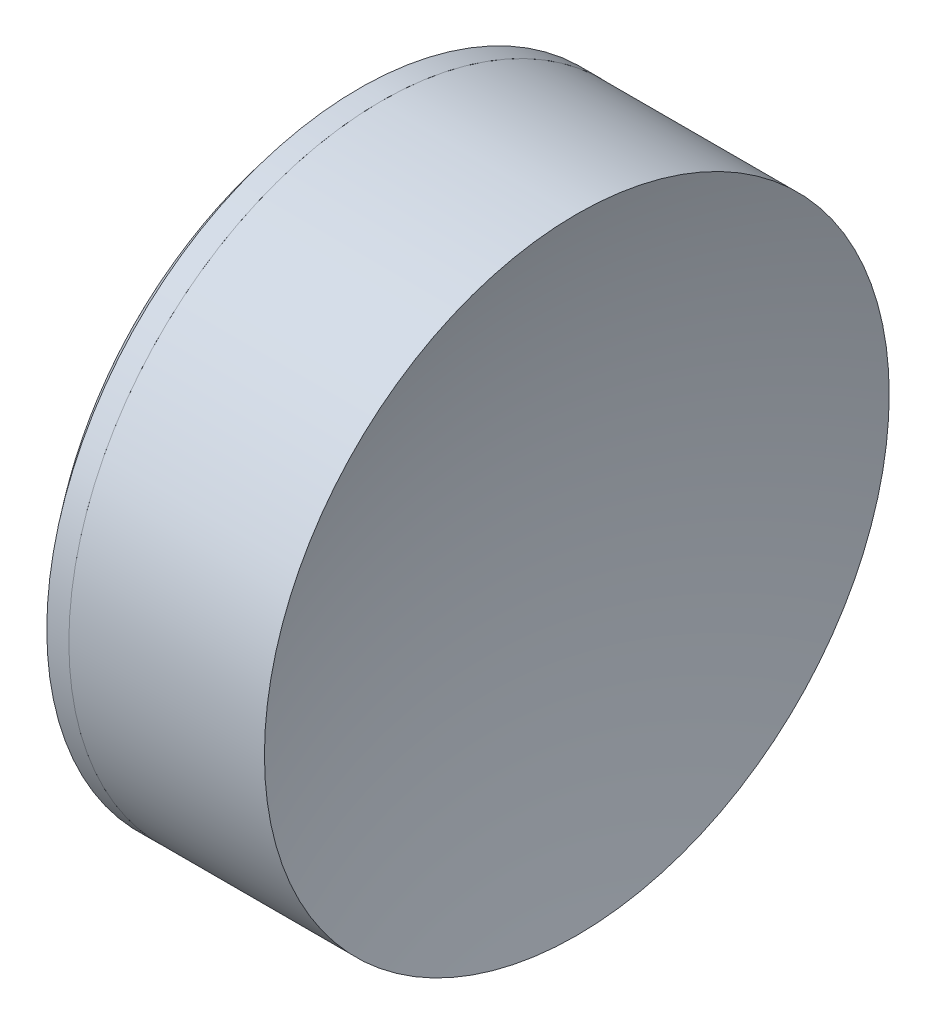
ISO-10303-21;
HEADER;
FILE_DESCRIPTION(('STEP AP214'),'2;1');
FILE_NAME('part.step','',(''),(''),'','','');
FILE_SCHEMA(('AUTOMOTIVE_DESIGN { 1 0 10303 214 1 1 1 1 }'));
ENDSEC;
DATA;
#1=APPLICATION_CONTEXT('core data for automotive mechanical design processes');
#2=APPLICATION_PROTOCOL_DEFINITION('international standard','automotive_design',2000,#1);
#3=PRODUCT_CONTEXT('',#1,'mechanical');
#4=PRODUCT('Part','Part','',(#3));
#5=PRODUCT_RELATED_PRODUCT_CATEGORY('part','',(#4));
#6=PRODUCT_DEFINITION_FORMATION('','',#4);
#7=PRODUCT_DEFINITION_CONTEXT('part definition',#1,'design');
#8=PRODUCT_DEFINITION('design','',#6,#7);
#9=PRODUCT_DEFINITION_SHAPE('','',#8);
#10=(LENGTH_UNIT() NAMED_UNIT(*) SI_UNIT(.MILLI.,.METRE.));
#11=(NAMED_UNIT(*) PLANE_ANGLE_UNIT() SI_UNIT($,.RADIAN.));
#12=(NAMED_UNIT(*) SI_UNIT($,.STERADIAN.) SOLID_ANGLE_UNIT());
#13=UNCERTAINTY_MEASURE_WITH_UNIT(LENGTH_MEASURE(1.E-05),#10,'distance_accuracy_value','');
#14=(GEOMETRIC_REPRESENTATION_CONTEXT(3) GLOBAL_UNCERTAINTY_ASSIGNED_CONTEXT((#13)) GLOBAL_UNIT_ASSIGNED_CONTEXT((#10,
#11,#12)) REPRESENTATION_CONTEXT('',''));
#15=CARTESIAN_POINT('',(0.,0.,0.));
#16=DIRECTION('',(0.,0.,1.));
#17=DIRECTION('',(1.,0.,0.));
#18=AXIS2_PLACEMENT_3D('',#15,#16,#17);
#19=CARTESIAN_POINT('',(61.3594437825909,0.,0.));
#20=DIRECTION('',(-1.,0.,0.));
#21=DIRECTION('',(0.,0.,-1.));
#22=AXIS2_PLACEMENT_3D('',#19,#20,#21);
#23=SPHERICAL_SURFACE('',#22,49.89);
#24=CARTESIAN_POINT('',(104.299542757791,0.,0.));
#25=DIRECTION('',(-1.,0.,0.));
#26=DIRECTION('',(0.,0.,1.));
#27=AXIS2_PLACEMENT_3D('',#24,#25,#26);
#28=CIRCLE('',#27,25.4);
#29=CARTESIAN_POINT('',(104.299542757791,0.,25.4));
#30=VERTEX_POINT('',#29);
#31=EDGE_CURVE('E51',#30,#30,#28,.T.);
#32=ORIENTED_EDGE('',*,*,#31,.T.);
#33=EDGE_LOOP('',(#32));
#34=FACE_BOUND('',#33,.T.);
#35=ADVANCED_FACE('F45',(#34),#23,.F.);
#36=CARTESIAN_POINT('',(199.849443782591,0.,0.));
#37=DIRECTION('',(-1.,0.,0.));
#38=DIRECTION('',(0.,0.,-1.));
#39=AXIS2_PLACEMENT_3D('',#36,#37,#38);
#40=SPHERICAL_SURFACE('',#39,83.6);
#41=CARTESIAN_POINT('',(120.201468290429,0.,0.));
#42=DIRECTION('',(-1.,0.,0.));
#43=DIRECTION('',(0.,0.,1.));
#44=AXIS2_PLACEMENT_3D('',#41,#42,#43);
#45=CIRCLE('',#44,25.4);
#46=CARTESIAN_POINT('',(120.201468290429,0.,25.4));
#47=VERTEX_POINT('',#46);
#48=EDGE_CURVE('E11',#47,#47,#45,.T.);
#49=ORIENTED_EDGE('',*,*,#48,.F.);
#50=EDGE_LOOP('',(#49));
#51=FACE_BOUND('',#50,.T.);
#52=ADVANCED_FACE('F60',(#51),#40,.F.);
#53=CARTESIAN_POINT('',(-0.551919992657797,0.,0.));
#54=DIRECTION('',(-1.,0.,0.));
#55=DIRECTION('',(0.,0.,1.));
#56=AXIS2_PLACEMENT_3D('',#53,#54,#55);
#57=CYLINDRICAL_SURFACE('',#56,25.4);
#58=ORIENTED_EDGE('',*,*,#48,.T.);
#59=EDGE_LOOP('',(#58));
#60=FACE_BOUND('',#59,.T.);
#61=ORIENTED_EDGE('',*,*,#31,.F.);
#62=EDGE_LOOP('',(#61));
#63=FACE_BOUND('',#62,.T.);
#64=ADVANCED_FACE('F58',(#60,#63),#57,.T.);
#65=CLOSED_SHELL('',(#35,#52,#64));
#66=MANIFOLD_SOLID_BREP('B2',#65);
#67=CARTESIAN_POINT('',(132.729443782591,0.,0.));
#68=DIRECTION('',(-1.,0.,0.));
#69=DIRECTION('',(0.,0.,1.));
#70=AXIS2_PLACEMENT_3D('',#67,#68,#69);
#71=SPHERICAL_SURFACE('',#70,39.48);
#72=CARTESIAN_POINT('',(102.505109215888,0.,0.));
#73=DIRECTION('',(-1.,0.,0.));
#74=DIRECTION('',(0.,0.,1.));
#75=AXIS2_PLACEMENT_3D('',#72,#73,#74);
#76=CIRCLE('',#75,25.4);
#77=CARTESIAN_POINT('',(102.505109215888,0.,25.4));
#78=VERTEX_POINT('',#77);
#79=EDGE_CURVE('E44',#78,#78,#76,.T.);
#80=ORIENTED_EDGE('',*,*,#79,.T.);
#81=EDGE_LOOP('',(#80));
#82=FACE_BOUND('',#81,.T.);
#83=ADVANCED_FACE('F86',(#82),#71,.T.);
#84=CARTESIAN_POINT('',(-0.816062176165804,0.,0.));
#85=DIRECTION('',(-1.,0.,0.));
#86=DIRECTION('',(0.,0.,1.));
#87=AXIS2_PLACEMENT_3D('',#84,#85,#86);
#88=CYLINDRICAL_SURFACE('',#87,25.4);
#89=CARTESIAN_POINT('',(104.299542757791,0.,0.));
#90=DIRECTION('',(-1.,0.,0.));
#91=DIRECTION('',(0.,0.,1.));
#92=AXIS2_PLACEMENT_3D('',#89,#90,#91);
#93=CIRCLE('',#92,25.4);
#94=CARTESIAN_POINT('',(104.299542757791,0.,25.4));
#95=VERTEX_POINT('',#94);
#96=EDGE_CURVE('E92',#95,#95,#93,.T.);
#97=ORIENTED_EDGE('',*,*,#96,.T.);
#98=EDGE_LOOP('',(#97));
#99=FACE_BOUND('',#98,.T.);
#100=ORIENTED_EDGE('',*,*,#79,.F.);
#101=EDGE_LOOP('',(#100));
#102=FACE_BOUND('',#101,.T.);
#103=ADVANCED_FACE('F98',(#99,#102),#88,.T.);
#104=CARTESIAN_POINT('',(61.3594437825909,0.,0.));
#105=DIRECTION('',(-1.,0.,0.));
#106=DIRECTION('',(0.,0.,1.));
#107=AXIS2_PLACEMENT_3D('',#104,#105,#106);
#108=SPHERICAL_SURFACE('',#107,49.89);
#109=ORIENTED_EDGE('',*,*,#96,.F.);
#110=EDGE_LOOP('',(#109));
#111=FACE_BOUND('',#110,.T.);
#112=ADVANCED_FACE('F101',(#111),#108,.T.);
#113=CLOSED_SHELL('',(#83,#103,#112));
#114=MANIFOLD_SOLID_BREP('B6',#113);
#115=ADVANCED_BREP_SHAPE_REPRESENTATION('',(#18,#66,#114),#14);
#116=SHAPE_DEFINITION_REPRESENTATION(#9,#115);
ENDSEC;
END-ISO-10303-21;
